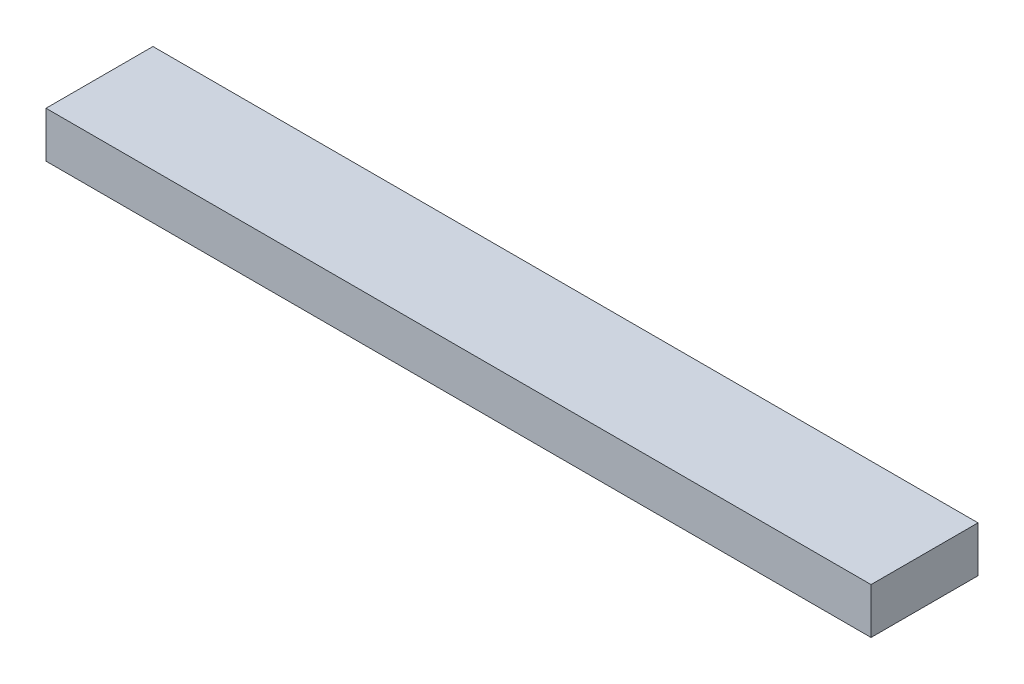
ISO-10303-21;
HEADER;
FILE_DESCRIPTION(('STEP AP214'),'2;1');
FILE_NAME('part.step','',(''),(''),'','','');
FILE_SCHEMA(('AUTOMOTIVE_DESIGN { 1 0 10303 214 1 1 1 1 }'));
ENDSEC;
DATA;
#1=APPLICATION_CONTEXT('core data for automotive mechanical design processes');
#2=APPLICATION_PROTOCOL_DEFINITION('international standard','automotive_design',2000,#1);
#3=PRODUCT_CONTEXT('',#1,'mechanical');
#4=PRODUCT('Part','Part','',(#3));
#5=PRODUCT_RELATED_PRODUCT_CATEGORY('part','',(#4));
#6=PRODUCT_DEFINITION_FORMATION('','',#4);
#7=PRODUCT_DEFINITION_CONTEXT('part definition',#1,'design');
#8=PRODUCT_DEFINITION('design','',#6,#7);
#9=PRODUCT_DEFINITION_SHAPE('','',#8);
#10=(LENGTH_UNIT() NAMED_UNIT(*) SI_UNIT(.MILLI.,.METRE.));
#11=(NAMED_UNIT(*) PLANE_ANGLE_UNIT() SI_UNIT($,.RADIAN.));
#12=(NAMED_UNIT(*) SI_UNIT($,.STERADIAN.) SOLID_ANGLE_UNIT());
#13=UNCERTAINTY_MEASURE_WITH_UNIT(LENGTH_MEASURE(1.E-05),#10,'distance_accuracy_value','');
#14=(GEOMETRIC_REPRESENTATION_CONTEXT(3) GLOBAL_UNCERTAINTY_ASSIGNED_CONTEXT((#13)) GLOBAL_UNIT_ASSIGNED_CONTEXT((#10,
#11,#12)) REPRESENTATION_CONTEXT('',''));
#15=CARTESIAN_POINT('',(0.,0.,0.));
#16=DIRECTION('',(0.,0.,1.));
#17=DIRECTION('',(1.,0.,0.));
#18=AXIS2_PLACEMENT_3D('',#15,#16,#17);
#19=CARTESIAN_POINT('',(0.,38.1,0.));
#20=DIRECTION('',(1.,0.,0.));
#21=DIRECTION('',(0.,0.,-1.));
#22=AXIS2_PLACEMENT_3D('',#19,#20,#21);
#23=PLANE('',#22);
#24=DIRECTION('',(0.,0.,1.));
#25=VECTOR('',#24,1.);
#26=CARTESIAN_POINT('',(0.,0.,0.));
#27=LINE('',#26,#25);
#28=CARTESIAN_POINT('',(0.,0.,-88.9));
#29=VERTEX_POINT('',#28);
#30=CARTESIAN_POINT('',(0.,0.,0.));
#31=VERTEX_POINT('',#30);
#32=EDGE_CURVE('E101',#29,#31,#27,.T.);
#33=ORIENTED_EDGE('',*,*,#32,.T.);
#34=DIRECTION('',(0.,-1.,0.));
#35=VECTOR('',#34,1.);
#36=CARTESIAN_POINT('',(0.,38.1,0.));
#37=LINE('',#36,#35);
#38=CARTESIAN_POINT('',(0.,38.1,0.));
#39=VERTEX_POINT('',#38);
#40=EDGE_CURVE('E11',#39,#31,#37,.T.);
#41=ORIENTED_EDGE('',*,*,#40,.F.);
#42=DIRECTION('',(0.,0.,1.));
#43=VECTOR('',#42,1.);
#44=CARTESIAN_POINT('',(0.,38.1,0.));
#45=LINE('',#44,#43);
#46=CARTESIAN_POINT('',(0.,38.1,-88.9));
#47=VERTEX_POINT('',#46);
#48=EDGE_CURVE('E89',#47,#39,#45,.T.);
#49=ORIENTED_EDGE('',*,*,#48,.F.);
#50=DIRECTION('',(0.,-1.,0.));
#51=VECTOR('',#50,1.);
#52=CARTESIAN_POINT('',(0.,38.1,-88.9));
#53=LINE('',#52,#51);
#54=EDGE_CURVE('E97',#47,#29,#53,.T.);
#55=ORIENTED_EDGE('',*,*,#54,.T.);
#56=EDGE_LOOP('',(#33,#41,#49,#55));
#57=FACE_BOUND('',#56,.T.);
#58=ADVANCED_FACE('F38',(#57),#23,.F.);
#59=CARTESIAN_POINT('',(0.,38.1,0.));
#60=DIRECTION('',(0.,0.,-1.));
#61=DIRECTION('',(-1.,0.,0.));
#62=AXIS2_PLACEMENT_3D('',#59,#60,#61);
#63=PLANE('',#62);
#64=DIRECTION('',(1.,0.,0.));
#65=VECTOR('',#64,1.);
#66=CARTESIAN_POINT('',(0.,0.,0.));
#67=LINE('',#66,#65);
#68=CARTESIAN_POINT('',(685.8,0.,0.));
#69=VERTEX_POINT('',#68);
#70=EDGE_CURVE('E93',#31,#69,#67,.T.);
#71=ORIENTED_EDGE('',*,*,#70,.T.);
#72=DIRECTION('',(0.,-1.,0.));
#73=VECTOR('',#72,1.);
#74=CARTESIAN_POINT('',(685.8,38.1,0.));
#75=LINE('',#74,#73);
#76=CARTESIAN_POINT('',(685.8,38.1,0.));
#77=VERTEX_POINT('',#76);
#78=EDGE_CURVE('E46',#77,#69,#75,.T.);
#79=ORIENTED_EDGE('',*,*,#78,.F.);
#80=DIRECTION('',(1.,0.,0.));
#81=VECTOR('',#80,1.);
#82=CARTESIAN_POINT('',(0.,38.1,0.));
#83=LINE('',#82,#81);
#84=EDGE_CURVE('E84',#39,#77,#83,.T.);
#85=ORIENTED_EDGE('',*,*,#84,.F.);
#86=ORIENTED_EDGE('',*,*,#40,.T.);
#87=EDGE_LOOP('',(#71,#79,#85,#86));
#88=FACE_BOUND('',#87,.T.);
#89=ADVANCED_FACE('F92',(#88),#63,.F.);
#90=CARTESIAN_POINT('',(685.8,38.1,0.));
#91=DIRECTION('',(-1.,0.,0.));
#92=DIRECTION('',(0.,0.,1.));
#93=AXIS2_PLACEMENT_3D('',#90,#91,#92);
#94=PLANE('',#93);
#95=DIRECTION('',(0.,0.,-1.));
#96=VECTOR('',#95,1.);
#97=CARTESIAN_POINT('',(685.8,0.,0.));
#98=LINE('',#97,#96);
#99=CARTESIAN_POINT('',(685.8,0.,-88.9));
#100=VERTEX_POINT('',#99);
#101=EDGE_CURVE('E71',#69,#100,#98,.T.);
#102=ORIENTED_EDGE('',*,*,#101,.T.);
#103=DIRECTION('',(0.,-1.,0.));
#104=VECTOR('',#103,1.);
#105=CARTESIAN_POINT('',(685.8,38.1,-88.9));
#106=LINE('',#105,#104);
#107=CARTESIAN_POINT('',(685.8,38.1,-88.9));
#108=VERTEX_POINT('',#107);
#109=EDGE_CURVE('E94',#108,#100,#106,.T.);
#110=ORIENTED_EDGE('',*,*,#109,.F.);
#111=DIRECTION('',(0.,0.,-1.));
#112=VECTOR('',#111,1.);
#113=CARTESIAN_POINT('',(685.8,38.1,0.));
#114=LINE('',#113,#112);
#115=EDGE_CURVE('E87',#77,#108,#114,.T.);
#116=ORIENTED_EDGE('',*,*,#115,.F.);
#117=ORIENTED_EDGE('',*,*,#78,.T.);
#118=EDGE_LOOP('',(#102,#110,#116,#117));
#119=FACE_BOUND('',#118,.T.);
#120=ADVANCED_FACE('F95',(#119),#94,.F.);
#121=CARTESIAN_POINT('',(0.,38.1,-88.9));
#122=DIRECTION('',(0.,0.,1.));
#123=DIRECTION('',(1.,0.,0.));
#124=AXIS2_PLACEMENT_3D('',#121,#122,#123);
#125=PLANE('',#124);
#126=DIRECTION('',(-1.,0.,0.));
#127=VECTOR('',#126,1.);
#128=CARTESIAN_POINT('',(0.,0.,-88.9));
#129=LINE('',#128,#127);
#130=EDGE_CURVE('E77',#100,#29,#129,.T.);
#131=ORIENTED_EDGE('',*,*,#130,.T.);
#132=ORIENTED_EDGE('',*,*,#54,.F.);
#133=DIRECTION('',(-1.,0.,0.));
#134=VECTOR('',#133,1.);
#135=CARTESIAN_POINT('',(0.,38.1,-88.9));
#136=LINE('',#135,#134);
#137=EDGE_CURVE('E54',#108,#47,#136,.T.);
#138=ORIENTED_EDGE('',*,*,#137,.F.);
#139=ORIENTED_EDGE('',*,*,#109,.T.);
#140=EDGE_LOOP('',(#131,#132,#138,#139));
#141=FACE_BOUND('',#140,.T.);
#142=ADVANCED_FACE('F108',(#141),#125,.F.);
#143=CARTESIAN_POINT('',(0.,38.1,0.));
#144=DIRECTION('',(0.,-1.,0.));
#145=DIRECTION('',(0.,0.,-1.));
#146=AXIS2_PLACEMENT_3D('',#143,#144,#145);
#147=PLANE('',#146);
#148=ORIENTED_EDGE('',*,*,#48,.T.);
#149=ORIENTED_EDGE('',*,*,#84,.T.);
#150=ORIENTED_EDGE('',*,*,#115,.T.);
#151=ORIENTED_EDGE('',*,*,#137,.T.);
#152=EDGE_LOOP('',(#148,#149,#150,#151));
#153=FACE_BOUND('',#152,.T.);
#154=ADVANCED_FACE('F85',(#153),#147,.F.);
#155=CARTESIAN_POINT('',(0.,0.,0.));
#156=DIRECTION('',(0.,-1.,0.));
#157=DIRECTION('',(0.,0.,-1.));
#158=AXIS2_PLACEMENT_3D('',#155,#156,#157);
#159=PLANE('',#158);
#160=ORIENTED_EDGE('',*,*,#32,.F.);
#161=ORIENTED_EDGE('',*,*,#130,.F.);
#162=ORIENTED_EDGE('',*,*,#101,.F.);
#163=ORIENTED_EDGE('',*,*,#70,.F.);
#164=EDGE_LOOP('',(#160,#161,#162,#163));
#165=FACE_BOUND('',#164,.T.);
#166=ADVANCED_FACE('F111',(#165),#159,.T.);
#167=CLOSED_SHELL('',(#58,#89,#120,#142,#154,#166));
#168=MANIFOLD_SOLID_BREP('B2',#167);
#169=ADVANCED_BREP_SHAPE_REPRESENTATION('',(#18,#168),#14);
#170=SHAPE_DEFINITION_REPRESENTATION(#9,#169);
ENDSEC;
END-ISO-10303-21;
